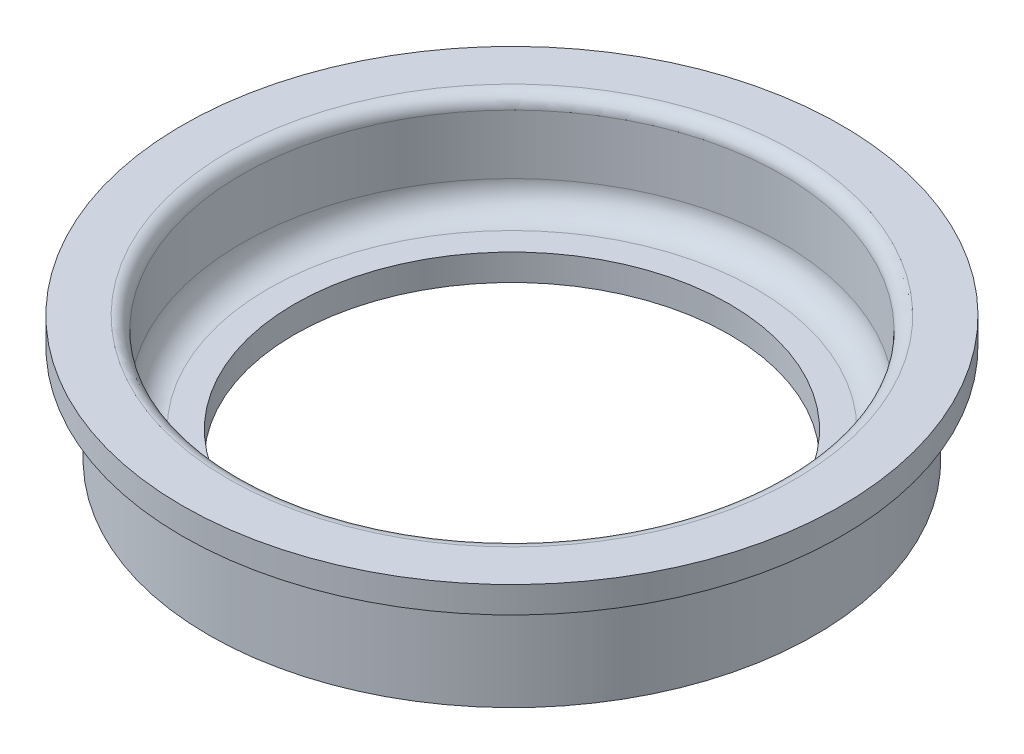
ISO-10303-21;
HEADER;
FILE_DESCRIPTION(('STEP AP214'),'2;1');
FILE_NAME('part.step','',(''),(''),'','','');
FILE_SCHEMA(('AUTOMOTIVE_DESIGN { 1 0 10303 214 1 1 1 1 }'));
ENDSEC;
DATA;
#1=APPLICATION_CONTEXT('core data for automotive mechanical design processes');
#2=APPLICATION_PROTOCOL_DEFINITION('international standard','automotive_design',2000,#1);
#3=PRODUCT_CONTEXT('',#1,'mechanical');
#4=PRODUCT('Part','Part','',(#3));
#5=PRODUCT_RELATED_PRODUCT_CATEGORY('part','',(#4));
#6=PRODUCT_DEFINITION_FORMATION('','',#4);
#7=PRODUCT_DEFINITION_CONTEXT('part definition',#1,'design');
#8=PRODUCT_DEFINITION('design','',#6,#7);
#9=PRODUCT_DEFINITION_SHAPE('','',#8);
#10=(LENGTH_UNIT() NAMED_UNIT(*) SI_UNIT(.MILLI.,.METRE.));
#11=(NAMED_UNIT(*) PLANE_ANGLE_UNIT() SI_UNIT($,.RADIAN.));
#12=(NAMED_UNIT(*) SI_UNIT($,.STERADIAN.) SOLID_ANGLE_UNIT());
#13=UNCERTAINTY_MEASURE_WITH_UNIT(LENGTH_MEASURE(1.E-05),#10,'distance_accuracy_value','');
#14=(GEOMETRIC_REPRESENTATION_CONTEXT(3) GLOBAL_UNCERTAINTY_ASSIGNED_CONTEXT((#13)) GLOBAL_UNIT_ASSIGNED_CONTEXT((#10,
#11,#12)) REPRESENTATION_CONTEXT('',''));
#15=CARTESIAN_POINT('',(0.,0.,0.));
#16=DIRECTION('',(0.,0.,1.));
#17=DIRECTION('',(1.,0.,0.));
#18=AXIS2_PLACEMENT_3D('',#15,#16,#17);
#19=CARTESIAN_POINT('',(-22.9999999999999,-3.99999999999995,0.));
#20=DIRECTION('',(0.,-1.,0.));
#21=DIRECTION('',(0.,0.,-1.));
#22=AXIS2_PLACEMENT_3D('',#19,#20,#21);
#23=PLANE('',#22);
#24=CARTESIAN_POINT('',(0.,-4.00000000000006,0.));
#25=DIRECTION('',(0.,1.,0.));
#26=DIRECTION('',(0.,0.,1.));
#27=AXIS2_PLACEMENT_3D('',#24,#25,#26);
#28=CIRCLE('',#27,16.5);
#29=CARTESIAN_POINT('',(0.,-4.00000000000006,16.5));
#30=VERTEX_POINT('',#29);
#31=EDGE_CURVE('E10',#30,#30,#28,.T.);
#32=ORIENTED_EDGE('',*,*,#31,.T.);
#33=EDGE_LOOP('',(#32));
#34=FACE_BOUND('',#33,.T.);
#35=CARTESIAN_POINT('',(0.,-4.00000000000006,0.));
#36=DIRECTION('',(0.,1.,0.));
#37=DIRECTION('',(0.,0.,1.));
#38=AXIS2_PLACEMENT_3D('',#35,#36,#37);
#39=CIRCLE('',#38,23.);
#40=CARTESIAN_POINT('',(0.,-4.00000000000006,23.));
#41=VERTEX_POINT('',#40);
#42=EDGE_CURVE('E58',#41,#41,#39,.T.);
#43=ORIENTED_EDGE('',*,*,#42,.F.);
#44=EDGE_LOOP('',(#43));
#45=FACE_BOUND('',#44,.T.);
#46=ADVANCED_FACE('F24',(#34,#45),#23,.T.);
#47=CARTESIAN_POINT('',(0.,27.6062610229278,0.));
#48=DIRECTION('',(0.,1.,0.));
#49=DIRECTION('',(0.,0.,1.));
#50=AXIS2_PLACEMENT_3D('',#47,#48,#49);
#51=CYLINDRICAL_SURFACE('',#50,16.5);
#52=CARTESIAN_POINT('',(0.,-1.99999999999995,0.));
#53=DIRECTION('',(0.,1.,0.));
#54=DIRECTION('',(0.,0.,1.));
#55=AXIS2_PLACEMENT_3D('',#52,#53,#54);
#56=CIRCLE('',#55,16.5);
#57=CARTESIAN_POINT('',(0.,-1.99999999999995,16.5));
#58=VERTEX_POINT('',#57);
#59=EDGE_CURVE('E30',#58,#58,#56,.T.);
#60=ORIENTED_EDGE('',*,*,#59,.T.);
#61=EDGE_LOOP('',(#60));
#62=FACE_BOUND('',#61,.T.);
#63=ORIENTED_EDGE('',*,*,#31,.F.);
#64=EDGE_LOOP('',(#63));
#65=FACE_BOUND('',#64,.T.);
#66=ADVANCED_FACE('F66',(#62,#65),#51,.F.);
#67=CARTESIAN_POINT('',(-16.5,-2.,0.));
#68=DIRECTION('',(0.,1.,0.));
#69=DIRECTION('',(0.,0.,1.));
#70=AXIS2_PLACEMENT_3D('',#67,#68,#69);
#71=PLANE('',#70);
#72=CARTESIAN_POINT('',(0.,-1.99999999999995,0.));
#73=DIRECTION('',(0.,1.,0.));
#74=DIRECTION('',(0.,0.,1.));
#75=AXIS2_PLACEMENT_3D('',#72,#73,#74);
#76=CIRCLE('',#75,18.5);
#77=CARTESIAN_POINT('',(0.,-1.99999999999995,18.5));
#78=VERTEX_POINT('',#77);
#79=EDGE_CURVE('E34',#78,#78,#76,.T.);
#80=ORIENTED_EDGE('',*,*,#79,.T.);
#81=EDGE_LOOP('',(#80));
#82=FACE_BOUND('',#81,.T.);
#83=ORIENTED_EDGE('',*,*,#59,.F.);
#84=EDGE_LOOP('',(#83));
#85=FACE_BOUND('',#84,.T.);
#86=ADVANCED_FACE('F70',(#82,#85),#71,.T.);
#87=CARTESIAN_POINT('',(0.,0.,0.));
#88=DIRECTION('',(0.,1.,0.));
#89=DIRECTION('',(0.,0.,1.));
#90=AXIS2_PLACEMENT_3D('',#87,#88,#89);
#91=TOROIDAL_SURFACE('',#90,18.5,2.);
#92=CARTESIAN_POINT('',(0.,0.,0.));
#93=DIRECTION('',(0.,1.,0.));
#94=DIRECTION('',(0.,0.,1.));
#95=AXIS2_PLACEMENT_3D('',#92,#93,#94);
#96=CIRCLE('',#95,20.5);
#97=CARTESIAN_POINT('',(0.,0.,20.5));
#98=VERTEX_POINT('',#97);
#99=EDGE_CURVE('E38',#98,#98,#96,.T.);
#100=ORIENTED_EDGE('',*,*,#99,.T.);
#101=EDGE_LOOP('',(#100));
#102=FACE_BOUND('',#101,.T.);
#103=ORIENTED_EDGE('',*,*,#79,.F.);
#104=EDGE_LOOP('',(#103));
#105=FACE_BOUND('',#104,.T.);
#106=ADVANCED_FACE('F74',(#102,#105),#91,.F.);
#107=CARTESIAN_POINT('',(0.,27.6062610229278,0.));
#108=DIRECTION('',(0.,1.,0.));
#109=DIRECTION('',(0.,0.,1.));
#110=AXIS2_PLACEMENT_3D('',#107,#108,#109);
#111=CYLINDRICAL_SURFACE('',#110,20.5);
#112=CARTESIAN_POINT('',(0.,4.5,0.));
#113=DIRECTION('',(0.,1.,0.));
#114=DIRECTION('',(0.,0.,1.));
#115=AXIS2_PLACEMENT_3D('',#112,#113,#114);
#116=CIRCLE('',#115,20.5);
#117=CARTESIAN_POINT('',(0.,4.5,20.5));
#118=VERTEX_POINT('',#117);
#119=EDGE_CURVE('E43',#118,#118,#116,.T.);
#120=ORIENTED_EDGE('',*,*,#119,.T.);
#121=EDGE_LOOP('',(#120));
#122=FACE_BOUND('',#121,.T.);
#123=ORIENTED_EDGE('',*,*,#99,.F.);
#124=EDGE_LOOP('',(#123));
#125=FACE_BOUND('',#124,.T.);
#126=ADVANCED_FACE('F81',(#122,#125),#111,.F.);
#127=CARTESIAN_POINT('',(0.,4.5,0.));
#128=DIRECTION('',(0.,1.,0.));
#129=DIRECTION('',(0.,0.,1.));
#130=AXIS2_PLACEMENT_3D('',#127,#128,#129);
#131=TOROIDAL_SURFACE('',#130,21.5,1.);
#132=CARTESIAN_POINT('',(0.,5.50000000000012,0.));
#133=DIRECTION('',(0.,1.,0.));
#134=DIRECTION('',(0.,0.,1.));
#135=AXIS2_PLACEMENT_3D('',#132,#133,#134);
#136=CIRCLE('',#135,21.5);
#137=CARTESIAN_POINT('',(0.,5.50000000000012,21.5));
#138=VERTEX_POINT('',#137);
#139=EDGE_CURVE('E46',#138,#138,#136,.T.);
#140=ORIENTED_EDGE('',*,*,#139,.T.);
#141=EDGE_LOOP('',(#140));
#142=FACE_BOUND('',#141,.T.);
#143=ORIENTED_EDGE('',*,*,#119,.F.);
#144=EDGE_LOOP('',(#143));
#145=FACE_BOUND('',#144,.T.);
#146=ADVANCED_FACE('F85',(#142,#145),#131,.T.);
#147=CARTESIAN_POINT('',(-21.5000000000001,5.50000000000012,0.));
#148=DIRECTION('',(0.,1.,0.));
#149=DIRECTION('',(0.,0.,1.));
#150=AXIS2_PLACEMENT_3D('',#147,#148,#149);
#151=PLANE('',#150);
#152=CARTESIAN_POINT('',(0.,5.50000000000012,0.));
#153=DIRECTION('',(0.,1.,0.));
#154=DIRECTION('',(0.,0.,1.));
#155=AXIS2_PLACEMENT_3D('',#152,#153,#154);
#156=CIRCLE('',#155,25.);
#157=CARTESIAN_POINT('',(0.,5.50000000000012,25.));
#158=VERTEX_POINT('',#157);
#159=EDGE_CURVE('E49',#158,#158,#156,.T.);
#160=ORIENTED_EDGE('',*,*,#159,.T.);
#161=EDGE_LOOP('',(#160));
#162=FACE_BOUND('',#161,.T.);
#163=ORIENTED_EDGE('',*,*,#139,.F.);
#164=EDGE_LOOP('',(#163));
#165=FACE_BOUND('',#164,.T.);
#166=ADVANCED_FACE('F89',(#162,#165),#151,.T.);
#167=CARTESIAN_POINT('',(0.,27.6062610229278,0.));
#168=DIRECTION('',(0.,1.,0.));
#169=DIRECTION('',(0.,0.,1.));
#170=AXIS2_PLACEMENT_3D('',#167,#168,#169);
#171=CYLINDRICAL_SURFACE('',#170,25.);
#172=CARTESIAN_POINT('',(0.,3.5,0.));
#173=DIRECTION('',(0.,1.,0.));
#174=DIRECTION('',(0.,0.,1.));
#175=AXIS2_PLACEMENT_3D('',#172,#173,#174);
#176=CIRCLE('',#175,25.);
#177=CARTESIAN_POINT('',(0.,3.5,25.));
#178=VERTEX_POINT('',#177);
#179=EDGE_CURVE('E52',#178,#178,#176,.T.);
#180=ORIENTED_EDGE('',*,*,#179,.T.);
#181=EDGE_LOOP('',(#180));
#182=FACE_BOUND('',#181,.T.);
#183=ORIENTED_EDGE('',*,*,#159,.F.);
#184=EDGE_LOOP('',(#183));
#185=FACE_BOUND('',#184,.T.);
#186=ADVANCED_FACE('F93',(#182,#185),#171,.T.);
#187=CARTESIAN_POINT('',(-24.9999999999999,3.50000000000011,0.));
#188=DIRECTION('',(0.,-1.,0.));
#189=DIRECTION('',(0.,0.,-1.));
#190=AXIS2_PLACEMENT_3D('',#187,#188,#189);
#191=PLANE('',#190);
#192=CARTESIAN_POINT('',(0.,3.5,0.));
#193=DIRECTION('',(0.,1.,0.));
#194=DIRECTION('',(0.,0.,1.));
#195=AXIS2_PLACEMENT_3D('',#192,#193,#194);
#196=CIRCLE('',#195,23.);
#197=CARTESIAN_POINT('',(0.,3.5,23.));
#198=VERTEX_POINT('',#197);
#199=EDGE_CURVE('E55',#198,#198,#196,.T.);
#200=ORIENTED_EDGE('',*,*,#199,.T.);
#201=EDGE_LOOP('',(#200));
#202=FACE_BOUND('',#201,.T.);
#203=ORIENTED_EDGE('',*,*,#179,.F.);
#204=EDGE_LOOP('',(#203));
#205=FACE_BOUND('',#204,.T.);
#206=ADVANCED_FACE('F97',(#202,#205),#191,.T.);
#207=CARTESIAN_POINT('',(0.,27.6062610229278,0.));
#208=DIRECTION('',(0.,1.,0.));
#209=DIRECTION('',(0.,0.,1.));
#210=AXIS2_PLACEMENT_3D('',#207,#208,#209);
#211=CYLINDRICAL_SURFACE('',#210,23.);
#212=ORIENTED_EDGE('',*,*,#42,.T.);
#213=EDGE_LOOP('',(#212));
#214=FACE_BOUND('',#213,.T.);
#215=ORIENTED_EDGE('',*,*,#199,.F.);
#216=EDGE_LOOP('',(#215));
#217=FACE_BOUND('',#216,.T.);
#218=ADVANCED_FACE('F62',(#214,#217),#211,.T.);
#219=CLOSED_SHELL('',(#46,#66,#86,#106,#126,#146,#166,#186,#206,#218));
#220=MANIFOLD_SOLID_BREP('B2',#219);
#221=ADVANCED_BREP_SHAPE_REPRESENTATION('',(#18,#220),#14);
#222=SHAPE_DEFINITION_REPRESENTATION(#9,#221);
ENDSEC;
END-ISO-10303-21;
